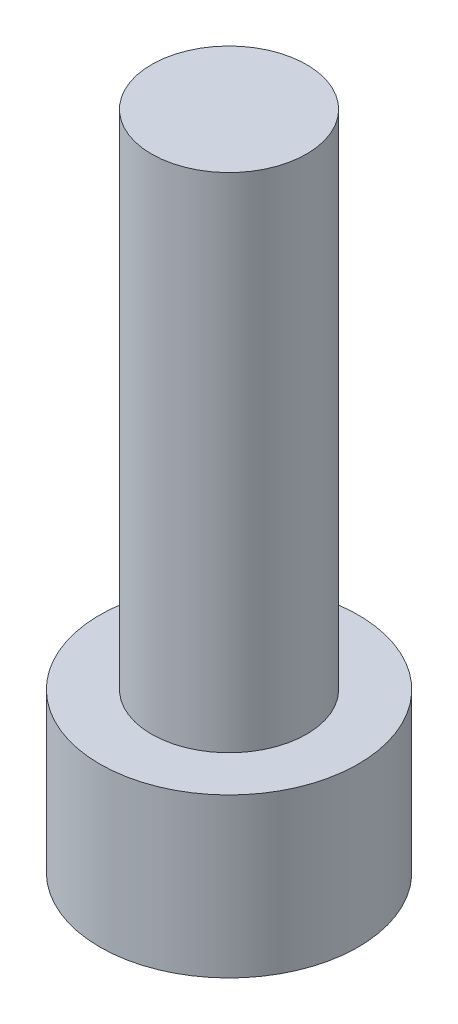
ISO-10303-21;
HEADER;
FILE_DESCRIPTION(('STEP AP214'),'2;1');
FILE_NAME('part.step','',(''),(''),'','','');
FILE_SCHEMA(('AUTOMOTIVE_DESIGN { 1 0 10303 214 1 1 1 1 }'));
ENDSEC;
DATA;
#1=APPLICATION_CONTEXT('core data for automotive mechanical design processes');
#2=APPLICATION_PROTOCOL_DEFINITION('international standard','automotive_design',2000,#1);
#3=PRODUCT_CONTEXT('',#1,'mechanical');
#4=PRODUCT('Part','Part','',(#3));
#5=PRODUCT_RELATED_PRODUCT_CATEGORY('part','',(#4));
#6=PRODUCT_DEFINITION_FORMATION('','',#4);
#7=PRODUCT_DEFINITION_CONTEXT('part definition',#1,'design');
#8=PRODUCT_DEFINITION('design','',#6,#7);
#9=PRODUCT_DEFINITION_SHAPE('','',#8);
#10=(LENGTH_UNIT() NAMED_UNIT(*) SI_UNIT(.MILLI.,.METRE.));
#11=(NAMED_UNIT(*) PLANE_ANGLE_UNIT() SI_UNIT($,.RADIAN.));
#12=(NAMED_UNIT(*) SI_UNIT($,.STERADIAN.) SOLID_ANGLE_UNIT());
#13=UNCERTAINTY_MEASURE_WITH_UNIT(LENGTH_MEASURE(1.E-05),#10,'distance_accuracy_value','');
#14=(GEOMETRIC_REPRESENTATION_CONTEXT(3) GLOBAL_UNCERTAINTY_ASSIGNED_CONTEXT((#13)) GLOBAL_UNIT_ASSIGNED_CONTEXT((#10,
#11,#12)) REPRESENTATION_CONTEXT('',''));
#15=CARTESIAN_POINT('',(0.,0.,0.));
#16=DIRECTION('',(0.,0.,1.));
#17=DIRECTION('',(1.,0.,0.));
#18=AXIS2_PLACEMENT_3D('',#15,#16,#17);
#19=CARTESIAN_POINT('',(0.,3.5052,0.));
#20=DIRECTION('',(0.,1.,0.));
#21=DIRECTION('',(0.,0.,1.));
#22=AXIS2_PLACEMENT_3D('',#19,#20,#21);
#23=PLANE('',#22);
#24=CARTESIAN_POINT('',(0.,3.5052,0.));
#25=DIRECTION('',(0.,1.,0.));
#26=DIRECTION('',(0.,0.,1.));
#27=AXIS2_PLACEMENT_3D('',#24,#25,#26);
#28=CIRCLE('',#27,2.8575);
#29=CARTESIAN_POINT('',(0.,3.5052,2.8575));
#30=VERTEX_POINT('',#29);
#31=EDGE_CURVE('E11',#30,#30,#28,.T.);
#32=ORIENTED_EDGE('',*,*,#31,.T.);
#33=EDGE_LOOP('',(#32));
#34=FACE_BOUND('',#33,.T.);
#35=CARTESIAN_POINT('',(0.,3.5052,0.));
#36=DIRECTION('',(0.,1.,0.));
#37=DIRECTION('',(0.,0.,1.));
#38=AXIS2_PLACEMENT_3D('',#35,#36,#37);
#39=CIRCLE('',#38,1.7145);
#40=CARTESIAN_POINT('',(0.,3.5052,1.7145));
#41=VERTEX_POINT('',#40);
#42=EDGE_CURVE('E152',#41,#41,#39,.T.);
#43=ORIENTED_EDGE('',*,*,#42,.F.);
#44=EDGE_LOOP('',(#43));
#45=FACE_BOUND('',#44,.T.);
#46=ADVANCED_FACE('F33',(#34,#45),#23,.T.);
#47=CARTESIAN_POINT('',(0.,3.5052,0.));
#48=DIRECTION('',(0.,-1.,0.));
#49=DIRECTION('',(0.,0.,-1.));
#50=AXIS2_PLACEMENT_3D('',#47,#48,#49);
#51=CYLINDRICAL_SURFACE('',#50,2.8575);
#52=ORIENTED_EDGE('',*,*,#31,.F.);
#53=EDGE_LOOP('',(#52));
#54=FACE_BOUND('',#53,.T.);
#55=CARTESIAN_POINT('',(0.,0.,0.));
#56=DIRECTION('',(0.,1.,0.));
#57=DIRECTION('',(0.,0.,1.));
#58=AXIS2_PLACEMENT_3D('',#55,#56,#57);
#59=CIRCLE('',#58,2.8575);
#60=CARTESIAN_POINT('',(0.,0.,2.8575));
#61=VERTEX_POINT('',#60);
#62=EDGE_CURVE('E37',#61,#61,#59,.T.);
#63=ORIENTED_EDGE('',*,*,#62,.T.);
#64=EDGE_LOOP('',(#63));
#65=FACE_BOUND('',#64,.T.);
#66=ADVANCED_FACE('F35',(#54,#65),#51,.T.);
#67=CARTESIAN_POINT('',(0.,0.,0.));
#68=DIRECTION('',(0.,1.,0.));
#69=DIRECTION('',(0.,0.,1.));
#70=AXIS2_PLACEMENT_3D('',#67,#68,#69);
#71=PLANE('',#70);
#72=DIRECTION('',(-0.500000000000001,0.,0.866025403784438));
#73=VECTOR('',#72,1.);
#74=CARTESIAN_POINT('',(1.60395121659243,0.,0.));
#75=LINE('',#74,#73);
#76=CARTESIAN_POINT('',(1.60395121659243,0.,0.));
#77=VERTEX_POINT('',#76);
#78=CARTESIAN_POINT('',(0.801975608296214,0.,1.3890625));
#79=VERTEX_POINT('',#78);
#80=EDGE_CURVE('E122',#77,#79,#75,.T.);
#81=ORIENTED_EDGE('',*,*,#80,.F.);
#82=DIRECTION('',(0.5,0.,0.866025403784439));
#83=VECTOR('',#82,1.);
#84=CARTESIAN_POINT('',(0.801975608296215,0.,-1.3890625));
#85=LINE('',#84,#83);
#86=CARTESIAN_POINT('',(0.801975608296215,0.,-1.3890625));
#87=VERTEX_POINT('',#86);
#88=EDGE_CURVE('E48',#87,#77,#85,.T.);
#89=ORIENTED_EDGE('',*,*,#88,.F.);
#90=DIRECTION('',(1.,0.,0.));
#91=VECTOR('',#90,1.);
#92=CARTESIAN_POINT('',(-0.801975608296214,0.,-1.3890625));
#93=LINE('',#92,#91);
#94=CARTESIAN_POINT('',(-0.801975608296214,0.,-1.3890625));
#95=VERTEX_POINT('',#94);
#96=EDGE_CURVE('E132',#95,#87,#93,.T.);
#97=ORIENTED_EDGE('',*,*,#96,.F.);
#98=DIRECTION('',(0.5,0.,-0.866025403784438));
#99=VECTOR('',#98,1.);
#100=CARTESIAN_POINT('',(-1.60395121659243,0.,0.));
#101=LINE('',#100,#99);
#102=CARTESIAN_POINT('',(-1.60395121659243,0.,0.));
#103=VERTEX_POINT('',#102);
#104=EDGE_CURVE('E130',#103,#95,#101,.T.);
#105=ORIENTED_EDGE('',*,*,#104,.F.);
#106=DIRECTION('',(-0.5,0.,-0.866025403784439));
#107=VECTOR('',#106,1.);
#108=CARTESIAN_POINT('',(-0.801975608296214,0.,1.3890625));
#109=LINE('',#108,#107);
#110=CARTESIAN_POINT('',(-0.801975608296214,0.,1.3890625));
#111=VERTEX_POINT('',#110);
#112=EDGE_CURVE('E96',#111,#103,#109,.T.);
#113=ORIENTED_EDGE('',*,*,#112,.F.);
#114=DIRECTION('',(-1.,0.,0.));
#115=VECTOR('',#114,1.);
#116=CARTESIAN_POINT('',(0.801975608296214,0.,1.3890625));
#117=LINE('',#116,#115);
#118=EDGE_CURVE('E126',#79,#111,#117,.T.);
#119=ORIENTED_EDGE('',*,*,#118,.F.);
#120=EDGE_LOOP('',(#81,#89,#97,#105,#113,#119));
#121=FACE_BOUND('',#120,.T.);
#122=ORIENTED_EDGE('',*,*,#62,.F.);
#123=EDGE_LOOP('',(#122));
#124=FACE_BOUND('',#123,.T.);
#125=ADVANCED_FACE('F145',(#121,#124),#71,.F.);
#126=CARTESIAN_POINT('',(0.801975608296215,1.9558,-1.3890625));
#127=DIRECTION('',(0.866025403784438,0.,-0.5));
#128=DIRECTION('',(-0.5,0.,-0.866025403784439));
#129=AXIS2_PLACEMENT_3D('',#126,#127,#128);
#130=PLANE('',#129);
#131=ORIENTED_EDGE('',*,*,#88,.T.);
#132=DIRECTION('',(0.,-1.,0.));
#133=VECTOR('',#132,1.);
#134=CARTESIAN_POINT('',(1.60395121659243,1.9558,0.));
#135=LINE('',#134,#133);
#136=CARTESIAN_POINT('',(1.60395121659243,1.9558,0.));
#137=VERTEX_POINT('',#136);
#138=EDGE_CURVE('E78',#137,#77,#135,.T.);
#139=ORIENTED_EDGE('',*,*,#138,.F.);
#140=DIRECTION('',(0.5,0.,0.866025403784439));
#141=VECTOR('',#140,1.);
#142=CARTESIAN_POINT('',(0.801975608296215,1.9558,-1.3890625));
#143=LINE('',#142,#141);
#144=CARTESIAN_POINT('',(0.801975608296215,1.9558,-1.3890625));
#145=VERTEX_POINT('',#144);
#146=EDGE_CURVE('E134',#145,#137,#143,.T.);
#147=ORIENTED_EDGE('',*,*,#146,.F.);
#148=DIRECTION('',(0.,-1.,0.));
#149=VECTOR('',#148,1.);
#150=CARTESIAN_POINT('',(0.801975608296215,1.9558,-1.3890625));
#151=LINE('',#150,#149);
#152=EDGE_CURVE('E56',#145,#87,#151,.T.);
#153=ORIENTED_EDGE('',*,*,#152,.T.);
#154=EDGE_LOOP('',(#131,#139,#147,#153));
#155=FACE_BOUND('',#154,.T.);
#156=ADVANCED_FACE('F174',(#155),#130,.F.);
#157=CARTESIAN_POINT('',(-0.801975608296214,1.9558,-1.3890625));
#158=DIRECTION('',(0.,0.,-1.));
#159=DIRECTION('',(-1.,0.,0.));
#160=AXIS2_PLACEMENT_3D('',#157,#158,#159);
#161=PLANE('',#160);
#162=ORIENTED_EDGE('',*,*,#96,.T.);
#163=ORIENTED_EDGE('',*,*,#152,.F.);
#164=DIRECTION('',(1.,0.,0.));
#165=VECTOR('',#164,1.);
#166=CARTESIAN_POINT('',(-0.801975608296214,1.9558,-1.3890625));
#167=LINE('',#166,#165);
#168=CARTESIAN_POINT('',(-0.801975608296214,1.9558,-1.3890625));
#169=VERTEX_POINT('',#168);
#170=EDGE_CURVE('E108',#169,#145,#167,.T.);
#171=ORIENTED_EDGE('',*,*,#170,.F.);
#172=DIRECTION('',(0.,-1.,0.));
#173=VECTOR('',#172,1.);
#174=CARTESIAN_POINT('',(-0.801975608296214,1.9558,-1.3890625));
#175=LINE('',#174,#173);
#176=EDGE_CURVE('E100',#169,#95,#175,.T.);
#177=ORIENTED_EDGE('',*,*,#176,.T.);
#178=EDGE_LOOP('',(#162,#163,#171,#177));
#179=FACE_BOUND('',#178,.T.);
#180=ADVANCED_FACE('F180',(#179),#161,.F.);
#181=CARTESIAN_POINT('',(-1.60395121659243,1.9558,0.));
#182=DIRECTION('',(-0.866025403784438,0.,-0.5));
#183=DIRECTION('',(-0.5,0.,0.866025403784439));
#184=AXIS2_PLACEMENT_3D('',#181,#182,#183);
#185=PLANE('',#184);
#186=ORIENTED_EDGE('',*,*,#104,.T.);
#187=ORIENTED_EDGE('',*,*,#176,.F.);
#188=DIRECTION('',(0.5,0.,-0.866025403784438));
#189=VECTOR('',#188,1.);
#190=CARTESIAN_POINT('',(-1.60395121659243,1.9558,0.));
#191=LINE('',#190,#189);
#192=CARTESIAN_POINT('',(-1.60395121659243,1.9558,0.));
#193=VERTEX_POINT('',#192);
#194=EDGE_CURVE('E104',#193,#169,#191,.T.);
#195=ORIENTED_EDGE('',*,*,#194,.F.);
#196=DIRECTION('',(0.,-1.,0.));
#197=VECTOR('',#196,1.);
#198=CARTESIAN_POINT('',(-1.60395121659243,1.9558,0.));
#199=LINE('',#198,#197);
#200=EDGE_CURVE('E89',#193,#103,#199,.T.);
#201=ORIENTED_EDGE('',*,*,#200,.T.);
#202=EDGE_LOOP('',(#186,#187,#195,#201));
#203=FACE_BOUND('',#202,.T.);
#204=ADVANCED_FACE('F105',(#203),#185,.F.);
#205=CARTESIAN_POINT('',(-0.801975608296214,1.9558,1.3890625));
#206=DIRECTION('',(-0.866025403784439,0.,0.5));
#207=DIRECTION('',(0.5,0.,0.866025403784439));
#208=AXIS2_PLACEMENT_3D('',#205,#206,#207);
#209=PLANE('',#208);
#210=ORIENTED_EDGE('',*,*,#112,.T.);
#211=ORIENTED_EDGE('',*,*,#200,.F.);
#212=DIRECTION('',(-0.5,0.,-0.866025403784439));
#213=VECTOR('',#212,1.);
#214=CARTESIAN_POINT('',(-0.801975608296214,1.9558,1.3890625));
#215=LINE('',#214,#213);
#216=CARTESIAN_POINT('',(-0.801975608296214,1.9558,1.3890625));
#217=VERTEX_POINT('',#216);
#218=EDGE_CURVE('E93',#217,#193,#215,.T.);
#219=ORIENTED_EDGE('',*,*,#218,.F.);
#220=DIRECTION('',(0.,-1.,0.));
#221=VECTOR('',#220,1.);
#222=CARTESIAN_POINT('',(-0.801975608296214,1.9558,1.3890625));
#223=LINE('',#222,#221);
#224=EDGE_CURVE('E101',#217,#111,#223,.T.);
#225=ORIENTED_EDGE('',*,*,#224,.T.);
#226=EDGE_LOOP('',(#210,#211,#219,#225));
#227=FACE_BOUND('',#226,.T.);
#228=ADVANCED_FACE('F91',(#227),#209,.F.);
#229=CARTESIAN_POINT('',(0.801975608296214,1.9558,1.3890625));
#230=DIRECTION('',(0.,0.,1.));
#231=DIRECTION('',(1.,0.,0.));
#232=AXIS2_PLACEMENT_3D('',#229,#230,#231);
#233=PLANE('',#232);
#234=ORIENTED_EDGE('',*,*,#118,.T.);
#235=ORIENTED_EDGE('',*,*,#224,.F.);
#236=DIRECTION('',(-1.,0.,0.));
#237=VECTOR('',#236,1.);
#238=CARTESIAN_POINT('',(0.801975608296214,1.9558,1.3890625));
#239=LINE('',#238,#237);
#240=CARTESIAN_POINT('',(0.801975608296214,1.9558,1.3890625));
#241=VERTEX_POINT('',#240);
#242=EDGE_CURVE('E114',#241,#217,#239,.T.);
#243=ORIENTED_EDGE('',*,*,#242,.F.);
#244=DIRECTION('',(0.,-1.,0.));
#245=VECTOR('',#244,1.);
#246=CARTESIAN_POINT('',(0.801975608296214,1.9558,1.3890625));
#247=LINE('',#246,#245);
#248=EDGE_CURVE('E138',#241,#79,#247,.T.);
#249=ORIENTED_EDGE('',*,*,#248,.T.);
#250=EDGE_LOOP('',(#234,#235,#243,#249));
#251=FACE_BOUND('',#250,.T.);
#252=ADVANCED_FACE('F149',(#251),#233,.F.);
#253=CARTESIAN_POINT('',(1.60395121659243,1.9558,0.));
#254=DIRECTION('',(0.866025403784438,0.,0.500000000000001));
#255=DIRECTION('',(0.500000000000001,0.,-0.866025403784438));
#256=AXIS2_PLACEMENT_3D('',#253,#254,#255);
#257=PLANE('',#256);
#258=ORIENTED_EDGE('',*,*,#80,.T.);
#259=ORIENTED_EDGE('',*,*,#248,.F.);
#260=DIRECTION('',(-0.500000000000001,0.,0.866025403784438));
#261=VECTOR('',#260,1.);
#262=CARTESIAN_POINT('',(1.60395121659243,1.9558,0.));
#263=LINE('',#262,#261);
#264=EDGE_CURVE('E116',#137,#241,#263,.T.);
#265=ORIENTED_EDGE('',*,*,#264,.F.);
#266=ORIENTED_EDGE('',*,*,#138,.T.);
#267=EDGE_LOOP('',(#258,#259,#265,#266));
#268=FACE_BOUND('',#267,.T.);
#269=ADVANCED_FACE('F142',(#268),#257,.F.);
#270=CARTESIAN_POINT('',(0.,1.9558,0.));
#271=DIRECTION('',(0.,-1.,0.));
#272=DIRECTION('',(0.,0.,-1.));
#273=AXIS2_PLACEMENT_3D('',#270,#271,#272);
#274=PLANE('',#273);
#275=ORIENTED_EDGE('',*,*,#146,.T.);
#276=ORIENTED_EDGE('',*,*,#264,.T.);
#277=ORIENTED_EDGE('',*,*,#242,.T.);
#278=ORIENTED_EDGE('',*,*,#218,.T.);
#279=ORIENTED_EDGE('',*,*,#194,.T.);
#280=ORIENTED_EDGE('',*,*,#170,.T.);
#281=EDGE_LOOP('',(#275,#276,#277,#278,#279,#280));
#282=FACE_BOUND('',#281,.T.);
#283=ADVANCED_FACE('F111',(#282),#274,.T.);
#284=CARTESIAN_POINT('',(0.,14.6177,0.));
#285=DIRECTION('',(0.,-1.,0.));
#286=DIRECTION('',(0.,0.,-1.));
#287=AXIS2_PLACEMENT_3D('',#284,#285,#286);
#288=CYLINDRICAL_SURFACE('',#287,1.7145);
#289=CARTESIAN_POINT('',(0.,14.6177,0.));
#290=DIRECTION('',(0.,1.,0.));
#291=DIRECTION('',(0.,0.,1.));
#292=AXIS2_PLACEMENT_3D('',#289,#290,#291);
#293=CIRCLE('',#292,1.7145);
#294=CARTESIAN_POINT('',(0.,14.6177,1.7145));
#295=VERTEX_POINT('',#294);
#296=EDGE_CURVE('E123',#295,#295,#293,.T.);
#297=ORIENTED_EDGE('',*,*,#296,.F.);
#298=EDGE_LOOP('',(#297));
#299=FACE_BOUND('',#298,.T.);
#300=ORIENTED_EDGE('',*,*,#42,.T.);
#301=EDGE_LOOP('',(#300));
#302=FACE_BOUND('',#301,.T.);
#303=ADVANCED_FACE('F160',(#299,#302),#288,.T.);
#304=CARTESIAN_POINT('',(0.,14.6177,0.));
#305=DIRECTION('',(0.,1.,0.));
#306=DIRECTION('',(0.,0.,1.));
#307=AXIS2_PLACEMENT_3D('',#304,#305,#306);
#308=PLANE('',#307);
#309=ORIENTED_EDGE('',*,*,#296,.T.);
#310=EDGE_LOOP('',(#309));
#311=FACE_BOUND('',#310,.T.);
#312=ADVANCED_FACE('F158',(#311),#308,.T.);
#313=CLOSED_SHELL('',(#46,#66,#125,#156,#180,#204,#228,#252,#269,#283,#303,#312));
#314=MANIFOLD_SOLID_BREP('B2',#313);
#315=ADVANCED_BREP_SHAPE_REPRESENTATION('',(#18,#314),#14);
#316=SHAPE_DEFINITION_REPRESENTATION(#9,#315);
ENDSEC;
END-ISO-10303-21;
